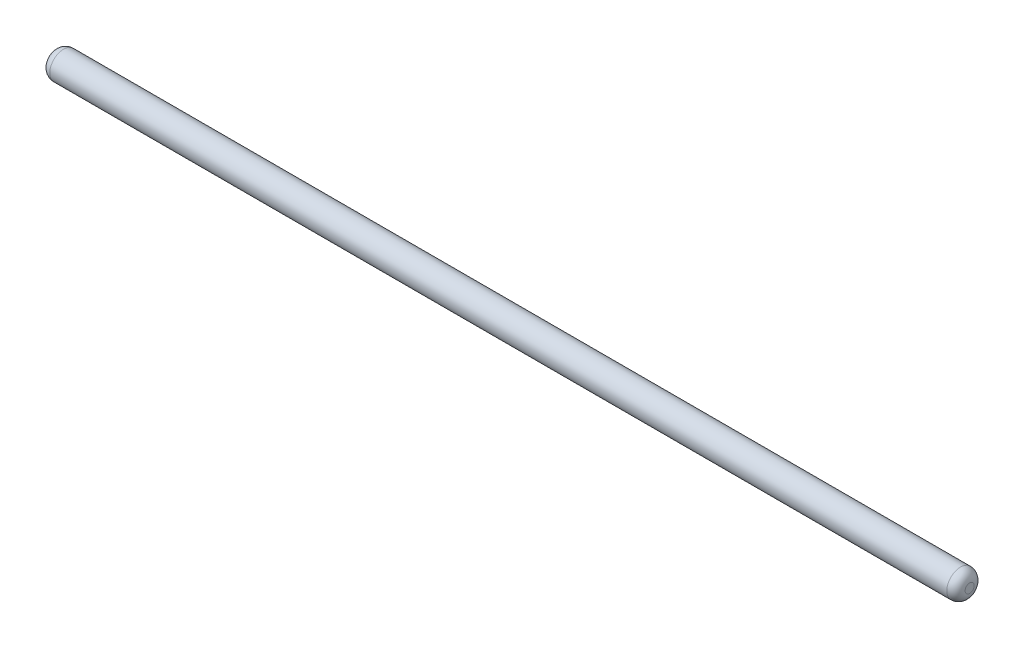
ISO-10303-21;
HEADER;
FILE_DESCRIPTION(('STEP AP214'),'2;1');
FILE_NAME('part.step','',(''),(''),'','','');
FILE_SCHEMA(('AUTOMOTIVE_DESIGN { 1 0 10303 214 1 1 1 1 }'));
ENDSEC;
DATA;
#1=APPLICATION_CONTEXT('core data for automotive mechanical design processes');
#2=APPLICATION_PROTOCOL_DEFINITION('international standard','automotive_design',2000,#1);
#3=PRODUCT_CONTEXT('',#1,'mechanical');
#4=PRODUCT('Part','Part','',(#3));
#5=PRODUCT_RELATED_PRODUCT_CATEGORY('part','',(#4));
#6=PRODUCT_DEFINITION_FORMATION('','',#4);
#7=PRODUCT_DEFINITION_CONTEXT('part definition',#1,'design');
#8=PRODUCT_DEFINITION('design','',#6,#7);
#9=PRODUCT_DEFINITION_SHAPE('','',#8);
#10=(LENGTH_UNIT() NAMED_UNIT(*) SI_UNIT(.MILLI.,.METRE.));
#11=(NAMED_UNIT(*) PLANE_ANGLE_UNIT() SI_UNIT($,.RADIAN.));
#12=(NAMED_UNIT(*) SI_UNIT($,.STERADIAN.) SOLID_ANGLE_UNIT());
#13=UNCERTAINTY_MEASURE_WITH_UNIT(LENGTH_MEASURE(1.E-05),#10,'distance_accuracy_value','');
#14=(GEOMETRIC_REPRESENTATION_CONTEXT(3) GLOBAL_UNCERTAINTY_ASSIGNED_CONTEXT((#13)) GLOBAL_UNIT_ASSIGNED_CONTEXT((#10,
#11,#12)) REPRESENTATION_CONTEXT('',''));
#15=CARTESIAN_POINT('',(0.,0.,0.));
#16=DIRECTION('',(0.,0.,1.));
#17=DIRECTION('',(1.,0.,0.));
#18=AXIS2_PLACEMENT_3D('',#15,#16,#17);
#19=CARTESIAN_POINT('',(0.,0.,0.));
#20=DIRECTION('',(1.,0.,0.));
#21=DIRECTION('',(0.,0.,-1.));
#22=AXIS2_PLACEMENT_3D('',#19,#20,#21);
#23=PLANE('',#22);
#24=CARTESIAN_POINT('',(0.,0.,0.));
#25=DIRECTION('',(-1.,0.,0.));
#26=DIRECTION('',(0.,0.,1.));
#27=AXIS2_PLACEMENT_3D('',#24,#25,#26);
#28=CIRCLE('',#27,0.5);
#29=CARTESIAN_POINT('',(0.,0.,0.5));
#30=VERTEX_POINT('',#29);
#31=EDGE_CURVE('E10',#30,#30,#28,.T.);
#32=ORIENTED_EDGE('',*,*,#31,.T.);
#33=EDGE_LOOP('',(#32));
#34=FACE_BOUND('',#33,.T.);
#35=ADVANCED_FACE('F37',(#34),#23,.F.);
#36=CARTESIAN_POINT('',(1.,0.,0.));
#37=DIRECTION('',(-1.,0.,0.));
#38=DIRECTION('',(0.,0.,1.));
#39=AXIS2_PLACEMENT_3D('',#36,#37,#38);
#40=DEGENERATE_TOROIDAL_SURFACE('',#39,0.5,1.,.T.);
#41=ORIENTED_EDGE('',*,*,#31,.F.);
#42=EDGE_LOOP('',(#41));
#43=FACE_BOUND('',#42,.T.);
#44=CARTESIAN_POINT('',(1.,0.,0.));
#45=DIRECTION('',(-1.,0.,0.));
#46=DIRECTION('',(0.,0.,1.));
#47=AXIS2_PLACEMENT_3D('',#44,#45,#46);
#48=CIRCLE('',#47,1.5);
#49=CARTESIAN_POINT('',(1.,0.,1.5));
#50=VERTEX_POINT('',#49);
#51=EDGE_CURVE('E44',#50,#50,#48,.T.);
#52=ORIENTED_EDGE('',*,*,#51,.T.);
#53=EDGE_LOOP('',(#52));
#54=FACE_BOUND('',#53,.T.);
#55=ADVANCED_FACE('F73',(#43,#54),#40,.T.);
#56=CARTESIAN_POINT('',(0.,0.,0.));
#57=DIRECTION('',(-1.,0.,0.));
#58=DIRECTION('',(0.,0.,1.));
#59=AXIS2_PLACEMENT_3D('',#56,#57,#58);
#60=CYLINDRICAL_SURFACE('',#59,1.5);
#61=ORIENTED_EDGE('',*,*,#51,.F.);
#62=EDGE_LOOP('',(#61));
#63=FACE_BOUND('',#62,.T.);
#64=CARTESIAN_POINT('',(99.,0.,0.));
#65=DIRECTION('',(-1.,0.,0.));
#66=DIRECTION('',(0.,0.,1.));
#67=AXIS2_PLACEMENT_3D('',#64,#65,#66);
#68=CIRCLE('',#67,1.5);
#69=CARTESIAN_POINT('',(99.,0.,1.5));
#70=VERTEX_POINT('',#69);
#71=EDGE_CURVE('E49',#70,#70,#68,.T.);
#72=ORIENTED_EDGE('',*,*,#71,.T.);
#73=EDGE_LOOP('',(#72));
#74=FACE_BOUND('',#73,.T.);
#75=ADVANCED_FACE('F69',(#63,#74),#60,.T.);
#76=CARTESIAN_POINT('',(99.,0.,0.));
#77=DIRECTION('',(-1.,0.,0.));
#78=DIRECTION('',(0.,0.,1.));
#79=AXIS2_PLACEMENT_3D('',#76,#77,#78);
#80=DEGENERATE_TOROIDAL_SURFACE('',#79,0.5,1.,.T.);
#81=ORIENTED_EDGE('',*,*,#71,.F.);
#82=EDGE_LOOP('',(#81));
#83=FACE_BOUND('',#82,.T.);
#84=CARTESIAN_POINT('',(100.,0.,0.));
#85=DIRECTION('',(-1.,0.,0.));
#86=DIRECTION('',(0.,0.,1.));
#87=AXIS2_PLACEMENT_3D('',#84,#85,#86);
#88=CIRCLE('',#87,0.5);
#89=CARTESIAN_POINT('',(100.,0.,0.5));
#90=VERTEX_POINT('',#89);
#91=EDGE_CURVE('E54',#90,#90,#88,.T.);
#92=ORIENTED_EDGE('',*,*,#91,.T.);
#93=EDGE_LOOP('',(#92));
#94=FACE_BOUND('',#93,.T.);
#95=ADVANCED_FACE('F61',(#83,#94),#80,.T.);
#96=CARTESIAN_POINT('',(100.,0.,0.));
#97=DIRECTION('',(-1.,0.,0.));
#98=DIRECTION('',(0.,0.,1.));
#99=AXIS2_PLACEMENT_3D('',#96,#97,#98);
#100=PLANE('',#99);
#101=ORIENTED_EDGE('',*,*,#91,.F.);
#102=EDGE_LOOP('',(#101));
#103=FACE_BOUND('',#102,.T.);
#104=ADVANCED_FACE('F63',(#103),#100,.F.);
#105=CLOSED_SHELL('',(#35,#55,#75,#95,#104));
#106=MANIFOLD_SOLID_BREP('B2',#105);
#107=ADVANCED_BREP_SHAPE_REPRESENTATION('',(#18,#106),#14);
#108=SHAPE_DEFINITION_REPRESENTATION(#9,#107);
ENDSEC;
END-ISO-10303-21;
